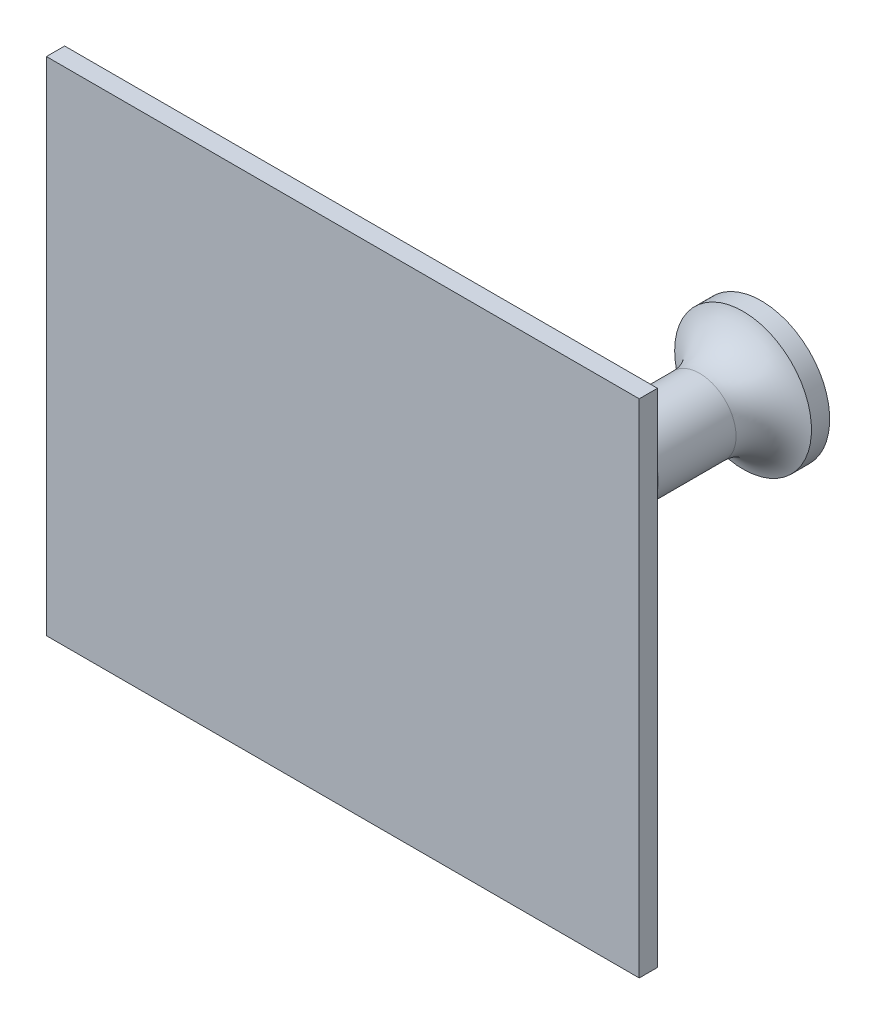
ISO-10303-21;
HEADER;
FILE_DESCRIPTION(('STEP AP214'),'2;1');
FILE_NAME('part.step','',(''),(''),'','','');
FILE_SCHEMA(('AUTOMOTIVE_DESIGN { 1 0 10303 214 1 1 1 1 }'));
ENDSEC;
DATA;
#1=APPLICATION_CONTEXT('core data for automotive mechanical design processes');
#2=APPLICATION_PROTOCOL_DEFINITION('international standard','automotive_design',2000,#1);
#3=PRODUCT_CONTEXT('',#1,'mechanical');
#4=PRODUCT('Part','Part','',(#3));
#5=PRODUCT_RELATED_PRODUCT_CATEGORY('part','',(#4));
#6=PRODUCT_DEFINITION_FORMATION('','',#4);
#7=PRODUCT_DEFINITION_CONTEXT('part definition',#1,'design');
#8=PRODUCT_DEFINITION('design','',#6,#7);
#9=PRODUCT_DEFINITION_SHAPE('','',#8);
#10=(LENGTH_UNIT() NAMED_UNIT(*) SI_UNIT(.MILLI.,.METRE.));
#11=(NAMED_UNIT(*) PLANE_ANGLE_UNIT() SI_UNIT($,.RADIAN.));
#12=(NAMED_UNIT(*) SI_UNIT($,.STERADIAN.) SOLID_ANGLE_UNIT());
#13=UNCERTAINTY_MEASURE_WITH_UNIT(LENGTH_MEASURE(1.E-05),#10,'distance_accuracy_value','');
#14=(GEOMETRIC_REPRESENTATION_CONTEXT(3) GLOBAL_UNCERTAINTY_ASSIGNED_CONTEXT((#13)) GLOBAL_UNIT_ASSIGNED_CONTEXT((#10,
#11,#12)) REPRESENTATION_CONTEXT('',''));
#15=CARTESIAN_POINT('',(0.,0.,0.));
#16=DIRECTION('',(0.,0.,1.));
#17=DIRECTION('',(1.,0.,0.));
#18=AXIS2_PLACEMENT_3D('',#15,#16,#17);
#19=CARTESIAN_POINT('',(32.5,50.,2.));
#20=DIRECTION('',(-1.,0.,0.));
#21=DIRECTION('',(0.,-1.,0.));
#22=AXIS2_PLACEMENT_3D('',#19,#20,#21);
#23=PLANE('',#22);
#24=DIRECTION('',(0.,1.,0.));
#25=VECTOR('',#24,1.);
#26=CARTESIAN_POINT('',(32.5,50.,2.));
#27=LINE('',#26,#25);
#28=CARTESIAN_POINT('',(32.5,-5.,2.));
#29=VERTEX_POINT('',#28);
#30=CARTESIAN_POINT('',(32.5,50.,2.));
#31=VERTEX_POINT('',#30);
#32=EDGE_CURVE('E91',#29,#31,#27,.T.);
#33=ORIENTED_EDGE('',*,*,#32,.F.);
#34=DIRECTION('',(0.,0.,-1.));
#35=VECTOR('',#34,1.);
#36=CARTESIAN_POINT('',(32.5,-5.,2.));
#37=LINE('',#36,#35);
#38=CARTESIAN_POINT('',(32.5,-5.,0.));
#39=VERTEX_POINT('',#38);
#40=EDGE_CURVE('E149',#29,#39,#37,.T.);
#41=ORIENTED_EDGE('',*,*,#40,.T.);
#42=DIRECTION('',(0.,1.,0.));
#43=VECTOR('',#42,1.);
#44=CARTESIAN_POINT('',(32.5,50.,0.));
#45=LINE('',#44,#43);
#46=CARTESIAN_POINT('',(32.5,50.,0.));
#47=VERTEX_POINT('',#46);
#48=EDGE_CURVE('E82',#39,#47,#45,.T.);
#49=ORIENTED_EDGE('',*,*,#48,.T.);
#50=DIRECTION('',(0.,0.,-1.));
#51=VECTOR('',#50,1.);
#52=CARTESIAN_POINT('',(32.5,50.,2.));
#53=LINE('',#52,#51);
#54=EDGE_CURVE('E77',#31,#47,#53,.T.);
#55=ORIENTED_EDGE('',*,*,#54,.F.);
#56=EDGE_LOOP('',(#33,#41,#49,#55));
#57=FACE_BOUND('',#56,.T.);
#58=ADVANCED_FACE('F34',(#57),#23,.F.);
#59=CARTESIAN_POINT('',(-32.5,50.,2.));
#60=DIRECTION('',(0.,-1.,0.));
#61=DIRECTION('',(0.,0.,-1.));
#62=AXIS2_PLACEMENT_3D('',#59,#60,#61);
#63=PLANE('',#62);
#64=DIRECTION('',(-1.,0.,0.));
#65=VECTOR('',#64,1.);
#66=CARTESIAN_POINT('',(-32.5,50.,0.));
#67=LINE('',#66,#65);
#68=CARTESIAN_POINT('',(-32.5,50.,0.));
#69=VERTEX_POINT('',#68);
#70=EDGE_CURVE('E71',#47,#69,#67,.T.);
#71=ORIENTED_EDGE('',*,*,#70,.T.);
#72=DIRECTION('',(0.,0.,-1.));
#73=VECTOR('',#72,1.);
#74=CARTESIAN_POINT('',(-32.5,50.,2.));
#75=LINE('',#74,#73);
#76=CARTESIAN_POINT('',(-32.5,50.,2.));
#77=VERTEX_POINT('',#76);
#78=EDGE_CURVE('E74',#77,#69,#75,.T.);
#79=ORIENTED_EDGE('',*,*,#78,.F.);
#80=DIRECTION('',(-1.,0.,0.));
#81=VECTOR('',#80,1.);
#82=CARTESIAN_POINT('',(-32.5,50.,2.));
#83=LINE('',#82,#81);
#84=EDGE_CURVE('E58',#31,#77,#83,.T.);
#85=ORIENTED_EDGE('',*,*,#84,.F.);
#86=ORIENTED_EDGE('',*,*,#54,.T.);
#87=EDGE_LOOP('',(#71,#79,#85,#86));
#88=FACE_BOUND('',#87,.T.);
#89=ADVANCED_FACE('F73',(#88),#63,.F.);
#90=CARTESIAN_POINT('',(-32.5,50.,2.));
#91=DIRECTION('',(1.,0.,0.));
#92=DIRECTION('',(0.,1.,0.));
#93=AXIS2_PLACEMENT_3D('',#90,#91,#92);
#94=PLANE('',#93);
#95=DIRECTION('',(0.,-1.,0.));
#96=VECTOR('',#95,1.);
#97=CARTESIAN_POINT('',(-32.5,50.,0.));
#98=LINE('',#97,#96);
#99=CARTESIAN_POINT('',(-32.5,-5.,0.));
#100=VERTEX_POINT('',#99);
#101=EDGE_CURVE('E81',#69,#100,#98,.T.);
#102=ORIENTED_EDGE('',*,*,#101,.T.);
#103=DIRECTION('',(0.,0.,-1.));
#104=VECTOR('',#103,1.);
#105=CARTESIAN_POINT('',(-32.5,-5.,2.));
#106=LINE('',#105,#104);
#107=CARTESIAN_POINT('',(-32.5,-5.,2.));
#108=VERTEX_POINT('',#107);
#109=EDGE_CURVE('E49',#108,#100,#106,.T.);
#110=ORIENTED_EDGE('',*,*,#109,.F.);
#111=DIRECTION('',(0.,-1.,0.));
#112=VECTOR('',#111,1.);
#113=CARTESIAN_POINT('',(-32.5,50.,2.));
#114=LINE('',#113,#112);
#115=EDGE_CURVE('E87',#77,#108,#114,.T.);
#116=ORIENTED_EDGE('',*,*,#115,.F.);
#117=ORIENTED_EDGE('',*,*,#78,.T.);
#118=EDGE_LOOP('',(#102,#110,#116,#117));
#119=FACE_BOUND('',#118,.T.);
#120=ADVANCED_FACE('F86',(#119),#94,.F.);
#121=CARTESIAN_POINT('',(0.,0.,2.));
#122=DIRECTION('',(0.,0.,1.));
#123=DIRECTION('',(1.,0.,0.));
#124=AXIS2_PLACEMENT_3D('',#121,#122,#123);
#125=PLANE('',#124);
#126=DIRECTION('',(1.,0.,0.));
#127=VECTOR('',#126,1.);
#128=CARTESIAN_POINT('',(32.5,-5.,2.));
#129=LINE('',#128,#127);
#130=EDGE_CURVE('E170',#108,#29,#129,.T.);
#131=ORIENTED_EDGE('',*,*,#130,.T.);
#132=ORIENTED_EDGE('',*,*,#32,.T.);
#133=ORIENTED_EDGE('',*,*,#84,.T.);
#134=ORIENTED_EDGE('',*,*,#115,.T.);
#135=EDGE_LOOP('',(#131,#132,#133,#134));
#136=FACE_BOUND('',#135,.T.);
#137=ADVANCED_FACE('F171',(#136),#125,.T.);
#138=CARTESIAN_POINT('',(0.,0.,0.));
#139=DIRECTION('',(0.,0.,1.));
#140=DIRECTION('',(1.,0.,0.));
#141=AXIS2_PLACEMENT_3D('',#138,#139,#140);
#142=PLANE('',#141);
#143=CARTESIAN_POINT('',(9.88444078871791,22.5027453747408,0.));
#144=DIRECTION('',(0.,0.,1.));
#145=DIRECTION('',(1.,0.,0.));
#146=AXIS2_PLACEMENT_3D('',#143,#144,#145);
#147=CIRCLE('',#146,6.);
#148=CARTESIAN_POINT('',(15.8844407887179,22.5027453747408,0.));
#149=VERTEX_POINT('',#148);
#150=EDGE_CURVE('E11',#149,#149,#147,.T.);
#151=ORIENTED_EDGE('',*,*,#150,.T.);
#152=EDGE_LOOP('',(#151));
#153=FACE_BOUND('',#152,.T.);
#154=ORIENTED_EDGE('',*,*,#48,.F.);
#155=DIRECTION('',(1.,0.,0.));
#156=VECTOR('',#155,1.);
#157=CARTESIAN_POINT('',(32.5,-5.,0.));
#158=LINE('',#157,#156);
#159=EDGE_CURVE('E90',#100,#39,#158,.T.);
#160=ORIENTED_EDGE('',*,*,#159,.F.);
#161=ORIENTED_EDGE('',*,*,#101,.F.);
#162=ORIENTED_EDGE('',*,*,#70,.F.);
#163=EDGE_LOOP('',(#154,#160,#161,#162));
#164=FACE_BOUND('',#163,.T.);
#165=ADVANCED_FACE('F89',(#153,#164),#142,.F.);
#166=CARTESIAN_POINT('',(9.88444078871791,22.5027453747408,-15.));
#167=DIRECTION('',(0.,0.,1.));
#168=DIRECTION('',(1.,0.,0.));
#169=AXIS2_PLACEMENT_3D('',#166,#167,#168);
#170=CYLINDRICAL_SURFACE('',#169,4.);
#171=CARTESIAN_POINT('',(9.88444078871791,22.5027453747408,-2.));
#172=DIRECTION('',(0.,0.,1.));
#173=DIRECTION('',(1.,0.,0.));
#174=AXIS2_PLACEMENT_3D('',#171,#172,#173);
#175=CIRCLE('',#174,4.);
#176=CARTESIAN_POINT('',(13.8844407887179,22.5027453747408,-2.));
#177=VERTEX_POINT('',#176);
#178=EDGE_CURVE('E42',#177,#177,#175,.F.);
#179=ORIENTED_EDGE('',*,*,#178,.T.);
#180=EDGE_LOOP('',(#179));
#181=FACE_BOUND('',#180,.T.);
#182=CARTESIAN_POINT('',(9.88444078871791,22.5027453747408,-13.2679491924311));
#183=DIRECTION('',(0.,0.,-1.));
#184=DIRECTION('',(-1.,0.,0.));
#185=AXIS2_PLACEMENT_3D('',#182,#183,#184);
#186=CIRCLE('',#185,4.);
#187=CARTESIAN_POINT('',(5.88444078871791,22.5027453747408,-13.2679491924311));
#188=VERTEX_POINT('',#187);
#189=EDGE_CURVE('E97',#188,#188,#186,.F.);
#190=ORIENTED_EDGE('',*,*,#189,.T.);
#191=EDGE_LOOP('',(#190));
#192=FACE_BOUND('',#191,.T.);
#193=ADVANCED_FACE('F108',(#181,#192),#170,.T.);
#194=CARTESIAN_POINT('',(9.88444078871791,22.5027453747408,-17.));
#195=DIRECTION('',(0.,0.,1.));
#196=DIRECTION('',(1.,0.,0.));
#197=AXIS2_PLACEMENT_3D('',#194,#195,#196);
#198=CYLINDRICAL_SURFACE('',#197,5.);
#199=CARTESIAN_POINT('',(9.88444078871791,22.5027453747408,-17.));
#200=DIRECTION('',(0.,0.,-1.));
#201=DIRECTION('',(-1.,0.,0.));
#202=AXIS2_PLACEMENT_3D('',#199,#200,#201);
#203=CIRCLE('',#202,5.);
#204=CARTESIAN_POINT('',(4.88444078871791,22.5027453747408,-17.));
#205=VERTEX_POINT('',#204);
#206=EDGE_CURVE('E158',#205,#205,#203,.T.);
#207=ORIENTED_EDGE('',*,*,#206,.F.);
#208=EDGE_LOOP('',(#207));
#209=FACE_BOUND('',#208,.T.);
#210=CARTESIAN_POINT('',(9.88444078871791,22.5027453747408,-15.));
#211=DIRECTION('',(0.,0.,-1.));
#212=DIRECTION('',(-1.,0.,0.));
#213=AXIS2_PLACEMENT_3D('',#210,#211,#212);
#214=CIRCLE('',#213,5.);
#215=CARTESIAN_POINT('',(4.88444078871791,22.5027453747408,-15.));
#216=VERTEX_POINT('',#215);
#217=EDGE_CURVE('E152',#216,#216,#214,.T.);
#218=ORIENTED_EDGE('',*,*,#217,.T.);
#219=EDGE_LOOP('',(#218));
#220=FACE_BOUND('',#219,.T.);
#221=ADVANCED_FACE('F185',(#209,#220),#198,.T.);
#222=CARTESIAN_POINT('',(9.88444078871791,22.5027453747408,-32.));
#223=DIRECTION('',(0.,0.,1.));
#224=DIRECTION('',(1.,0.,0.));
#225=AXIS2_PLACEMENT_3D('',#222,#223,#224);
#226=CYLINDRICAL_SURFACE('',#225,4.);
#227=CARTESIAN_POINT('',(9.88444078871791,22.5027453747408,-27.2303039929153));
#228=DIRECTION('',(0.,0.,-1.));
#229=DIRECTION('',(-1.,0.,0.));
#230=AXIS2_PLACEMENT_3D('',#227,#228,#229);
#231=CIRCLE('',#230,4.);
#232=CARTESIAN_POINT('',(5.88444078871791,22.5027453747408,-27.2303039929153));
#233=VERTEX_POINT('',#232);
#234=EDGE_CURVE('E103',#233,#233,#231,.F.);
#235=ORIENTED_EDGE('',*,*,#234,.T.);
#236=EDGE_LOOP('',(#235));
#237=FACE_BOUND('',#236,.T.);
#238=CARTESIAN_POINT('',(9.88444078871791,22.5027453747408,-18.7320508075689));
#239=DIRECTION('',(0.,0.,1.));
#240=DIRECTION('',(1.,0.,0.));
#241=AXIS2_PLACEMENT_3D('',#238,#239,#240);
#242=CIRCLE('',#241,4.);
#243=CARTESIAN_POINT('',(13.8844407887179,22.5027453747408,-18.7320508075689));
#244=VERTEX_POINT('',#243);
#245=EDGE_CURVE('E100',#244,#244,#242,.F.);
#246=ORIENTED_EDGE('',*,*,#245,.T.);
#247=EDGE_LOOP('',(#246));
#248=FACE_BOUND('',#247,.T.);
#249=ADVANCED_FACE('F188',(#237,#248),#226,.T.);
#250=CARTESIAN_POINT('',(9.88444078871791,22.5027453747408,-34.));
#251=DIRECTION('',(0.,0.,1.));
#252=DIRECTION('',(1.,0.,0.));
#253=AXIS2_PLACEMENT_3D('',#250,#251,#252);
#254=CYLINDRICAL_SURFACE('',#253,7.5);
#255=CARTESIAN_POINT('',(9.88444078871791,22.5027453747408,-34.));
#256=DIRECTION('',(0.,0.,-1.));
#257=DIRECTION('',(-1.,0.,0.));
#258=AXIS2_PLACEMENT_3D('',#255,#256,#257);
#259=CIRCLE('',#258,7.5);
#260=CARTESIAN_POINT('',(2.38444078871791,22.5027453747408,-34.));
#261=VERTEX_POINT('',#260);
#262=EDGE_CURVE('E148',#261,#261,#259,.T.);
#263=ORIENTED_EDGE('',*,*,#262,.F.);
#264=EDGE_LOOP('',(#263));
#265=FACE_BOUND('',#264,.T.);
#266=CARTESIAN_POINT('',(9.88444078871791,22.5027453747408,-32.));
#267=DIRECTION('',(0.,0.,-1.));
#268=DIRECTION('',(-1.,0.,0.));
#269=AXIS2_PLACEMENT_3D('',#266,#267,#268);
#270=CIRCLE('',#269,7.5);
#271=CARTESIAN_POINT('',(2.38444078871791,22.5027453747408,-32.));
#272=VERTEX_POINT('',#271);
#273=EDGE_CURVE('E146',#272,#272,#270,.T.);
#274=ORIENTED_EDGE('',*,*,#273,.T.);
#275=EDGE_LOOP('',(#274));
#276=FACE_BOUND('',#275,.T.);
#277=ADVANCED_FACE('F192',(#265,#276),#254,.T.);
#278=CARTESIAN_POINT('',(9.88444078871791,22.5027453747408,-34.));
#279=DIRECTION('',(0.,0.,-1.));
#280=DIRECTION('',(-1.,0.,0.));
#281=AXIS2_PLACEMENT_3D('',#278,#279,#280);
#282=PLANE('',#281);
#283=ORIENTED_EDGE('',*,*,#262,.T.);
#284=EDGE_LOOP('',(#283));
#285=FACE_BOUND('',#284,.T.);
#286=ADVANCED_FACE('F134',(#285),#282,.T.);
#287=CARTESIAN_POINT('',(9.88444078871791,22.5027453747408,-13.2679491924311));
#288=DIRECTION('',(0.,0.,-1.));
#289=DIRECTION('',(-1.,0.,0.));
#290=AXIS2_PLACEMENT_3D('',#287,#288,#289);
#291=TOROIDAL_SURFACE('',#290,6.,2.);
#292=ORIENTED_EDGE('',*,*,#189,.F.);
#293=EDGE_LOOP('',(#292));
#294=FACE_BOUND('',#293,.T.);
#295=ORIENTED_EDGE('',*,*,#217,.F.);
#296=EDGE_LOOP('',(#295));
#297=FACE_BOUND('',#296,.T.);
#298=ADVANCED_FACE('F130',(#294,#297),#291,.F.);
#299=CARTESIAN_POINT('',(9.88444078871791,22.5027453747408,-18.7320508075689));
#300=DIRECTION('',(0.,0.,1.));
#301=DIRECTION('',(1.,0.,0.));
#302=AXIS2_PLACEMENT_3D('',#299,#300,#301);
#303=TOROIDAL_SURFACE('',#302,6.,2.);
#304=ORIENTED_EDGE('',*,*,#206,.T.);
#305=EDGE_LOOP('',(#304));
#306=FACE_BOUND('',#305,.T.);
#307=ORIENTED_EDGE('',*,*,#245,.F.);
#308=EDGE_LOOP('',(#307));
#309=FACE_BOUND('',#308,.T.);
#310=ADVANCED_FACE('F133',(#306,#309),#303,.F.);
#311=CARTESIAN_POINT('',(9.88444078871791,22.5027453747408,-27.2303039929153));
#312=DIRECTION('',(0.,0.,-1.));
#313=DIRECTION('',(-1.,0.,0.));
#314=AXIS2_PLACEMENT_3D('',#311,#312,#313);
#315=TOROIDAL_SURFACE('',#314,9.,5.);
#316=ORIENTED_EDGE('',*,*,#234,.F.);
#317=EDGE_LOOP('',(#316));
#318=FACE_BOUND('',#317,.T.);
#319=ORIENTED_EDGE('',*,*,#273,.F.);
#320=EDGE_LOOP('',(#319));
#321=FACE_BOUND('',#320,.T.);
#322=ADVANCED_FACE('F117',(#318,#321),#315,.F.);
#323=CARTESIAN_POINT('',(32.5,-5.,2.));
#324=DIRECTION('',(0.,1.,0.));
#325=DIRECTION('',(0.,0.,1.));
#326=AXIS2_PLACEMENT_3D('',#323,#324,#325);
#327=PLANE('',#326);
#328=ORIENTED_EDGE('',*,*,#159,.T.);
#329=ORIENTED_EDGE('',*,*,#40,.F.);
#330=ORIENTED_EDGE('',*,*,#130,.F.);
#331=ORIENTED_EDGE('',*,*,#109,.T.);
#332=EDGE_LOOP('',(#328,#329,#330,#331));
#333=FACE_BOUND('',#332,.T.);
#334=ADVANCED_FACE('F112',(#333),#327,.F.);
#335=CARTESIAN_POINT('',(9.88444078871791,22.5027453747408,-2.));
#336=DIRECTION('',(0.,0.,1.));
#337=DIRECTION('',(1.,0.,0.));
#338=AXIS2_PLACEMENT_3D('',#335,#336,#337);
#339=TOROIDAL_SURFACE('',#338,6.,2.);
#340=ORIENTED_EDGE('',*,*,#150,.F.);
#341=EDGE_LOOP('',(#340));
#342=FACE_BOUND('',#341,.T.);
#343=ORIENTED_EDGE('',*,*,#178,.F.);
#344=EDGE_LOOP('',(#343));
#345=FACE_BOUND('',#344,.T.);
#346=ADVANCED_FACE('F36',(#342,#345),#339,.F.);
#347=CLOSED_SHELL('',(#58,#89,#120,#137,#165,#193,#221,#249,#277,#286,#298,#310,#322,#334,#346));
#348=MANIFOLD_SOLID_BREP('B2',#347);
#349=ADVANCED_BREP_SHAPE_REPRESENTATION('',(#18,#348),#14);
#350=SHAPE_DEFINITION_REPRESENTATION(#9,#349);
ENDSEC;
END-ISO-10303-21;
